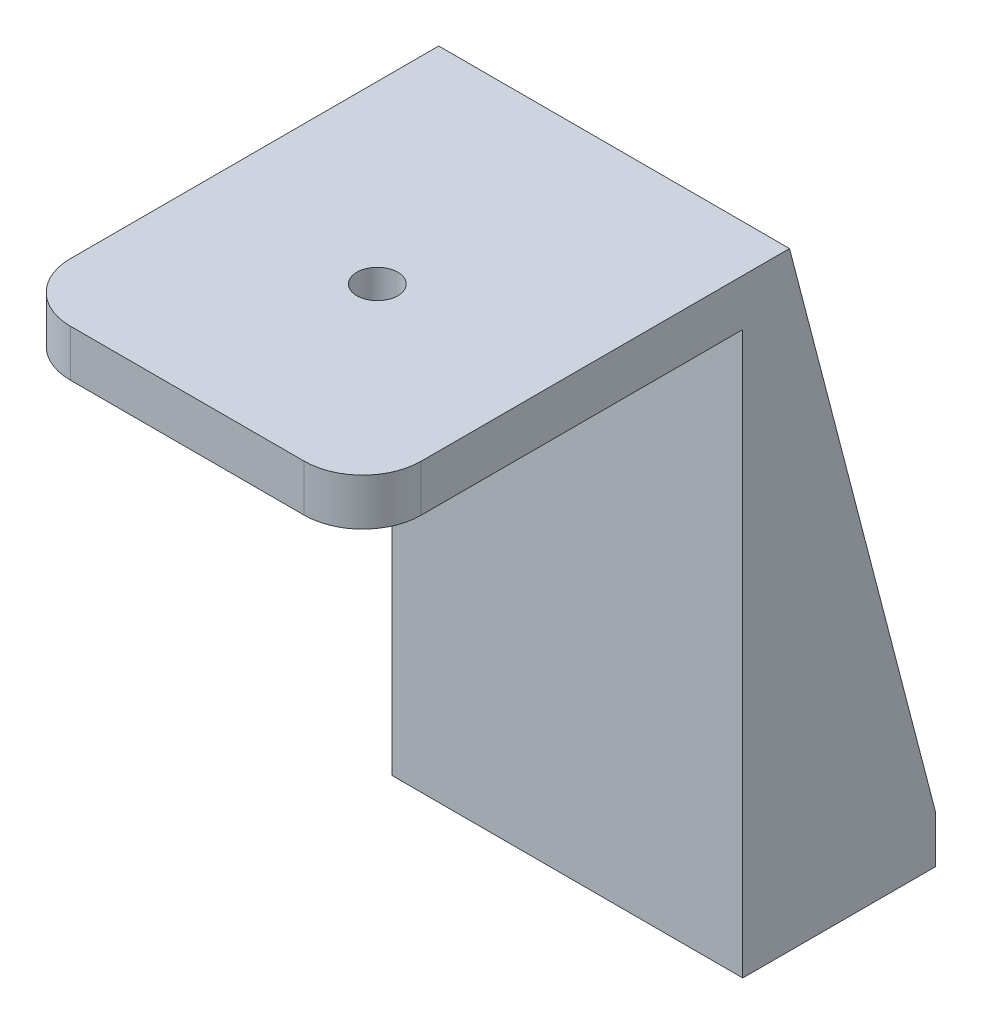
ISO-10303-21;
HEADER;
FILE_DESCRIPTION(('STEP AP214'),'2;1');
FILE_NAME('part.step','',(''),(''),'','','');
FILE_SCHEMA(('AUTOMOTIVE_DESIGN { 1 0 10303 214 1 1 1 1 }'));
ENDSEC;
DATA;
#1=APPLICATION_CONTEXT('core data for automotive mechanical design processes');
#2=APPLICATION_PROTOCOL_DEFINITION('international standard','automotive_design',2000,#1);
#3=PRODUCT_CONTEXT('',#1,'mechanical');
#4=PRODUCT('Part','Part','',(#3));
#5=PRODUCT_RELATED_PRODUCT_CATEGORY('part','',(#4));
#6=PRODUCT_DEFINITION_FORMATION('','',#4);
#7=PRODUCT_DEFINITION_CONTEXT('part definition',#1,'design');
#8=PRODUCT_DEFINITION('design','',#6,#7);
#9=PRODUCT_DEFINITION_SHAPE('','',#8);
#10=(LENGTH_UNIT() NAMED_UNIT(*) SI_UNIT(.MILLI.,.METRE.));
#11=(NAMED_UNIT(*) PLANE_ANGLE_UNIT() SI_UNIT($,.RADIAN.));
#12=(NAMED_UNIT(*) SI_UNIT($,.STERADIAN.) SOLID_ANGLE_UNIT());
#13=UNCERTAINTY_MEASURE_WITH_UNIT(LENGTH_MEASURE(1.E-05),#10,'distance_accuracy_value','');
#14=(GEOMETRIC_REPRESENTATION_CONTEXT(3) GLOBAL_UNCERTAINTY_ASSIGNED_CONTEXT((#13)) GLOBAL_UNIT_ASSIGNED_CONTEXT((#10,
#11,#12)) REPRESENTATION_CONTEXT('',''));
#15=CARTESIAN_POINT('',(0.,0.,0.));
#16=DIRECTION('',(0.,0.,1.));
#17=DIRECTION('',(1.,0.,0.));
#18=AXIS2_PLACEMENT_3D('',#15,#16,#17);
#19=CARTESIAN_POINT('',(-30.,-96.05,-40.5));
#20=DIRECTION('',(0.,0.,-1.));
#21=DIRECTION('',(-1.,0.,0.));
#22=AXIS2_PLACEMENT_3D('',#19,#20,#21);
#23=PLANE('',#22);
#24=DIRECTION('',(1.,0.,0.));
#25=VECTOR('',#24,1.);
#26=CARTESIAN_POINT('',(30.,-88.05,-40.5));
#27=LINE('',#26,#25);
#28=CARTESIAN_POINT('',(-25.,-88.05,-40.5));
#29=VERTEX_POINT('',#28);
#30=CARTESIAN_POINT('',(25.,-88.05,-40.5));
#31=VERTEX_POINT('',#30);
#32=EDGE_CURVE('E37',#29,#31,#27,.T.);
#33=ORIENTED_EDGE('',*,*,#32,.F.);
#34=DIRECTION('',(0.,-1.,0.));
#35=VECTOR('',#34,1.);
#36=CARTESIAN_POINT('',(-25.,-88.05,-40.5));
#37=LINE('',#36,#35);
#38=CARTESIAN_POINT('',(-25.,8.,-40.5));
#39=VERTEX_POINT('',#38);
#40=EDGE_CURVE('E126',#39,#29,#37,.T.);
#41=ORIENTED_EDGE('',*,*,#40,.F.);
#42=DIRECTION('',(-1.,0.,0.));
#43=VECTOR('',#42,1.);
#44=CARTESIAN_POINT('',(-30.,8.,-40.5));
#45=LINE('',#44,#43);
#46=CARTESIAN_POINT('',(25.,8.,-40.5));
#47=VERTEX_POINT('',#46);
#48=EDGE_CURVE('E145',#47,#39,#45,.T.);
#49=ORIENTED_EDGE('',*,*,#48,.F.);
#50=DIRECTION('',(0.,-1.,0.));
#51=VECTOR('',#50,1.);
#52=CARTESIAN_POINT('',(25.,-88.05,-40.5));
#53=LINE('',#52,#51);
#54=EDGE_CURVE('E260',#47,#31,#53,.T.);
#55=ORIENTED_EDGE('',*,*,#54,.T.);
#56=EDGE_LOOP('',(#33,#41,#49,#55));
#57=FACE_BOUND('',#56,.T.);
#58=ADVANCED_FACE('F33',(#57),#23,.T.);
#59=CARTESIAN_POINT('',(30.,-88.05,-65.5));
#60=DIRECTION('',(0.,-1.,0.));
#61=DIRECTION('',(0.,0.,-1.));
#62=AXIS2_PLACEMENT_3D('',#59,#60,#61);
#63=PLANE('',#62);
#64=DIRECTION('',(0.,0.,-1.));
#65=VECTOR('',#64,1.);
#66=CARTESIAN_POINT('',(-25.,-88.05,-65.5));
#67=LINE('',#66,#65);
#68=CARTESIAN_POINT('',(-25.,-88.05,-65.5));
#69=VERTEX_POINT('',#68);
#70=EDGE_CURVE('E128',#29,#69,#67,.T.);
#71=ORIENTED_EDGE('',*,*,#70,.F.);
#72=ORIENTED_EDGE('',*,*,#32,.T.);
#73=DIRECTION('',(0.,0.,-1.));
#74=VECTOR('',#73,1.);
#75=CARTESIAN_POINT('',(25.,-88.05,-65.5));
#76=LINE('',#75,#74);
#77=CARTESIAN_POINT('',(25.,-88.05,-65.5));
#78=VERTEX_POINT('',#77);
#79=EDGE_CURVE('E263',#31,#78,#76,.T.);
#80=ORIENTED_EDGE('',*,*,#79,.T.);
#81=DIRECTION('',(1.,0.,0.));
#82=VECTOR('',#81,1.);
#83=CARTESIAN_POINT('',(30.,-88.05,-65.5));
#84=LINE('',#83,#82);
#85=EDGE_CURVE('E154',#69,#78,#84,.T.);
#86=ORIENTED_EDGE('',*,*,#85,.F.);
#87=EDGE_LOOP('',(#71,#72,#80,#86));
#88=FACE_BOUND('',#87,.T.);
#89=ADVANCED_FACE('F295',(#88),#63,.F.);
#90=CARTESIAN_POINT('',(-30.,8.,-32.5));
#91=DIRECTION('',(1.,0.,0.));
#92=DIRECTION('',(0.,0.,-1.));
#93=AXIS2_PLACEMENT_3D('',#90,#91,#92);
#94=PLANE('',#93);
#95=DIRECTION('',(0.,0.,1.));
#96=VECTOR('',#95,1.);
#97=CARTESIAN_POINT('',(-30.,8.,-32.5));
#98=LINE('',#97,#96);
#99=CARTESIAN_POINT('',(-30.,8.,-40.5));
#100=VERTEX_POINT('',#99);
#101=CARTESIAN_POINT('',(-30.,8.,22.5));
#102=VERTEX_POINT('',#101);
#103=EDGE_CURVE('E182',#100,#102,#98,.T.);
#104=ORIENTED_EDGE('',*,*,#103,.F.);
#105=DIRECTION('',(0.,0.967756221524935,0.251888657346417));
#106=VECTOR('',#105,1.);
#107=CARTESIAN_POINT('',(-30.,8.,-40.5));
#108=LINE('',#107,#106);
#109=CARTESIAN_POINT('',(-30.,-88.05,-65.5));
#110=VERTEX_POINT('',#109);
#111=EDGE_CURVE('E135',#110,#100,#108,.T.);
#112=ORIENTED_EDGE('',*,*,#111,.F.);
#113=DIRECTION('',(0.,1.,0.));
#114=VECTOR('',#113,1.);
#115=CARTESIAN_POINT('',(-30.,-96.05,-65.5));
#116=LINE('',#115,#114);
#117=CARTESIAN_POINT('',(-30.,-96.05,-65.5));
#118=VERTEX_POINT('',#117);
#119=EDGE_CURVE('E245',#118,#110,#116,.T.);
#120=ORIENTED_EDGE('',*,*,#119,.F.);
#121=DIRECTION('',(0.,0.,1.));
#122=VECTOR('',#121,1.);
#123=CARTESIAN_POINT('',(-30.,-96.05,-32.5));
#124=LINE('',#123,#122);
#125=CARTESIAN_POINT('',(-30.,-96.05,-32.5));
#126=VERTEX_POINT('',#125);
#127=EDGE_CURVE('E152',#118,#126,#124,.T.);
#128=ORIENTED_EDGE('',*,*,#127,.T.);
#129=DIRECTION('',(0.,1.,0.));
#130=VECTOR('',#129,1.);
#131=CARTESIAN_POINT('',(-30.,-96.05,-32.5));
#132=LINE('',#131,#130);
#133=CARTESIAN_POINT('',(-30.,0.,-32.5));
#134=VERTEX_POINT('',#133);
#135=EDGE_CURVE('E169',#126,#134,#132,.T.);
#136=ORIENTED_EDGE('',*,*,#135,.T.);
#137=DIRECTION('',(0.,0.,1.));
#138=VECTOR('',#137,1.);
#139=CARTESIAN_POINT('',(-30.,0.,-32.5));
#140=LINE('',#139,#138);
#141=CARTESIAN_POINT('',(-30.,0.,22.5));
#142=VERTEX_POINT('',#141);
#143=EDGE_CURVE('E179',#134,#142,#140,.T.);
#144=ORIENTED_EDGE('',*,*,#143,.T.);
#145=DIRECTION('',(0.,-1.,0.));
#146=VECTOR('',#145,1.);
#147=CARTESIAN_POINT('',(-30.,8.,22.5));
#148=LINE('',#147,#146);
#149=EDGE_CURVE('E211',#142,#102,#148,.F.);
#150=ORIENTED_EDGE('',*,*,#149,.T.);
#151=EDGE_LOOP('',(#104,#112,#120,#128,#136,#144,#150));
#152=FACE_BOUND('',#151,.T.);
#153=ADVANCED_FACE('F231',(#152),#94,.F.);
#154=CARTESIAN_POINT('',(-30.,8.,32.5));
#155=DIRECTION('',(0.,0.,-1.));
#156=DIRECTION('',(-1.,0.,0.));
#157=AXIS2_PLACEMENT_3D('',#154,#155,#156);
#158=PLANE('',#157);
#159=DIRECTION('',(1.,0.,0.));
#160=VECTOR('',#159,1.);
#161=CARTESIAN_POINT('',(-30.,8.,32.5));
#162=LINE('',#161,#160);
#163=CARTESIAN_POINT('',(-20.,8.,32.5));
#164=VERTEX_POINT('',#163);
#165=CARTESIAN_POINT('',(20.,8.,32.5));
#166=VERTEX_POINT('',#165);
#167=EDGE_CURVE('E184',#164,#166,#162,.T.);
#168=ORIENTED_EDGE('',*,*,#167,.F.);
#169=DIRECTION('',(0.,-1.,0.));
#170=VECTOR('',#169,1.);
#171=CARTESIAN_POINT('',(-20.,8.,32.5));
#172=LINE('',#171,#170);
#173=CARTESIAN_POINT('',(-20.,0.,32.5));
#174=VERTEX_POINT('',#173);
#175=EDGE_CURVE('E206',#164,#174,#172,.T.);
#176=ORIENTED_EDGE('',*,*,#175,.T.);
#177=DIRECTION('',(1.,0.,0.));
#178=VECTOR('',#177,1.);
#179=CARTESIAN_POINT('',(-30.,0.,32.5));
#180=LINE('',#179,#178);
#181=CARTESIAN_POINT('',(20.,0.,32.5));
#182=VERTEX_POINT('',#181);
#183=EDGE_CURVE('E190',#174,#182,#180,.T.);
#184=ORIENTED_EDGE('',*,*,#183,.T.);
#185=DIRECTION('',(0.,-1.,0.));
#186=VECTOR('',#185,1.);
#187=CARTESIAN_POINT('',(20.,8.,32.5));
#188=LINE('',#187,#186);
#189=EDGE_CURVE('E189',#182,#166,#188,.F.);
#190=ORIENTED_EDGE('',*,*,#189,.T.);
#191=EDGE_LOOP('',(#168,#176,#184,#190));
#192=FACE_BOUND('',#191,.T.);
#193=ADVANCED_FACE('F221',(#192),#158,.F.);
#194=CARTESIAN_POINT('',(30.,8.,-32.5));
#195=DIRECTION('',(-1.,0.,0.));
#196=DIRECTION('',(0.,0.,1.));
#197=AXIS2_PLACEMENT_3D('',#194,#195,#196);
#198=PLANE('',#197);
#199=DIRECTION('',(0.,0.967756221524935,0.251888657346417));
#200=VECTOR('',#199,1.);
#201=CARTESIAN_POINT('',(30.,8.,-40.5));
#202=LINE('',#201,#200);
#203=CARTESIAN_POINT('',(30.,-88.05,-65.5));
#204=VERTEX_POINT('',#203);
#205=CARTESIAN_POINT('',(30.,8.,-40.5));
#206=VERTEX_POINT('',#205);
#207=EDGE_CURVE('E139',#204,#206,#202,.T.);
#208=ORIENTED_EDGE('',*,*,#207,.T.);
#209=DIRECTION('',(0.,0.,-1.));
#210=VECTOR('',#209,1.);
#211=CARTESIAN_POINT('',(30.,8.,-32.5));
#212=LINE('',#211,#210);
#213=CARTESIAN_POINT('',(30.,8.,22.5));
#214=VERTEX_POINT('',#213);
#215=EDGE_CURVE('E187',#214,#206,#212,.T.);
#216=ORIENTED_EDGE('',*,*,#215,.F.);
#217=DIRECTION('',(0.,-1.,0.));
#218=VECTOR('',#217,1.);
#219=CARTESIAN_POINT('',(30.,8.,22.5));
#220=LINE('',#219,#218);
#221=CARTESIAN_POINT('',(30.,0.,22.5));
#222=VERTEX_POINT('',#221);
#223=EDGE_CURVE('E11',#214,#222,#220,.T.);
#224=ORIENTED_EDGE('',*,*,#223,.T.);
#225=DIRECTION('',(0.,0.,-1.));
#226=VECTOR('',#225,1.);
#227=CARTESIAN_POINT('',(30.,0.,-32.5));
#228=LINE('',#227,#226);
#229=CARTESIAN_POINT('',(30.,0.,-32.5));
#230=VERTEX_POINT('',#229);
#231=EDGE_CURVE('E193',#222,#230,#228,.T.);
#232=ORIENTED_EDGE('',*,*,#231,.T.);
#233=DIRECTION('',(0.,1.,0.));
#234=VECTOR('',#233,1.);
#235=CARTESIAN_POINT('',(30.,-96.05,-32.5));
#236=LINE('',#235,#234);
#237=CARTESIAN_POINT('',(30.,-96.05,-32.5));
#238=VERTEX_POINT('',#237);
#239=EDGE_CURVE('E165',#238,#230,#236,.T.);
#240=ORIENTED_EDGE('',*,*,#239,.F.);
#241=DIRECTION('',(0.,0.,-1.));
#242=VECTOR('',#241,1.);
#243=CARTESIAN_POINT('',(30.,-96.05,-32.5));
#244=LINE('',#243,#242);
#245=CARTESIAN_POINT('',(30.,-96.05,-65.5));
#246=VERTEX_POINT('',#245);
#247=EDGE_CURVE('E158',#238,#246,#244,.T.);
#248=ORIENTED_EDGE('',*,*,#247,.T.);
#249=DIRECTION('',(0.,-1.,0.));
#250=VECTOR('',#249,1.);
#251=CARTESIAN_POINT('',(30.,-96.05,-65.5));
#252=LINE('',#251,#250);
#253=EDGE_CURVE('E251',#204,#246,#252,.T.);
#254=ORIENTED_EDGE('',*,*,#253,.F.);
#255=EDGE_LOOP('',(#208,#216,#224,#232,#240,#248,#254));
#256=FACE_BOUND('',#255,.T.);
#257=ADVANCED_FACE('F277',(#256),#198,.F.);
#258=CARTESIAN_POINT('',(-30.,8.,32.5));
#259=DIRECTION('',(0.,1.,0.));
#260=DIRECTION('',(0.,0.,1.));
#261=AXIS2_PLACEMENT_3D('',#258,#259,#260);
#262=PLANE('',#261);
#263=CARTESIAN_POINT('',(0.,8.,0.));
#264=DIRECTION('',(0.,-1.,0.));
#265=DIRECTION('',(0.,0.,-1.));
#266=AXIS2_PLACEMENT_3D('',#263,#264,#265);
#267=CIRCLE('',#266,3.5);
#268=CARTESIAN_POINT('',(0.,8.,-3.5));
#269=VERTEX_POINT('',#268);
#270=EDGE_CURVE('E170',#269,#269,#267,.T.);
#271=ORIENTED_EDGE('',*,*,#270,.T.);
#272=EDGE_LOOP('',(#271));
#273=FACE_BOUND('',#272,.T.);
#274=ORIENTED_EDGE('',*,*,#103,.T.);
#275=CARTESIAN_POINT('',(-20.,8.,22.5));
#276=DIRECTION('',(0.,1.,0.));
#277=DIRECTION('',(0.,0.,1.));
#278=AXIS2_PLACEMENT_3D('',#275,#276,#277);
#279=CIRCLE('',#278,10.);
#280=EDGE_CURVE('E43',#102,#164,#279,.T.);
#281=ORIENTED_EDGE('',*,*,#280,.T.);
#282=ORIENTED_EDGE('',*,*,#167,.T.);
#283=CARTESIAN_POINT('',(20.,8.,22.5));
#284=DIRECTION('',(0.,1.,0.));
#285=DIRECTION('',(0.,0.,1.));
#286=AXIS2_PLACEMENT_3D('',#283,#284,#285);
#287=CIRCLE('',#286,10.);
#288=EDGE_CURVE('E58',#166,#214,#287,.T.);
#289=ORIENTED_EDGE('',*,*,#288,.T.);
#290=ORIENTED_EDGE('',*,*,#215,.T.);
#291=EDGE_CURVE('E149',#206,#47,#45,.T.);
#292=ORIENTED_EDGE('',*,*,#291,.T.);
#293=ORIENTED_EDGE('',*,*,#48,.T.);
#294=DIRECTION('',(-1.,0.,0.));
#295=VECTOR('',#294,1.);
#296=CARTESIAN_POINT('',(-25.,8.,-40.5));
#297=LINE('',#296,#295);
#298=EDGE_CURVE('E132',#39,#100,#297,.T.);
#299=ORIENTED_EDGE('',*,*,#298,.T.);
#300=EDGE_LOOP('',(#274,#281,#282,#289,#290,#292,#293,#299));
#301=FACE_BOUND('',#300,.T.);
#302=ADVANCED_FACE('F148',(#273,#301),#262,.T.);
#303=CARTESIAN_POINT('',(-30.,0.,32.5));
#304=DIRECTION('',(0.,1.,0.));
#305=DIRECTION('',(0.,0.,1.));
#306=AXIS2_PLACEMENT_3D('',#303,#304,#305);
#307=PLANE('',#306);
#308=CARTESIAN_POINT('',(0.,0.,0.));
#309=DIRECTION('',(0.,-1.,0.));
#310=DIRECTION('',(0.,0.,-1.));
#311=AXIS2_PLACEMENT_3D('',#308,#309,#310);
#312=CIRCLE('',#311,19.05);
#313=CARTESIAN_POINT('',(0.,0.,-19.05));
#314=VERTEX_POINT('',#313);
#315=EDGE_CURVE('E173',#314,#314,#312,.T.);
#316=ORIENTED_EDGE('',*,*,#315,.F.);
#317=EDGE_LOOP('',(#316));
#318=FACE_BOUND('',#317,.T.);
#319=ORIENTED_EDGE('',*,*,#183,.F.);
#320=CARTESIAN_POINT('',(-20.,0.,22.5));
#321=DIRECTION('',(0.,1.,0.));
#322=DIRECTION('',(0.,0.,1.));
#323=AXIS2_PLACEMENT_3D('',#320,#321,#322);
#324=CIRCLE('',#323,10.);
#325=EDGE_CURVE('E209',#174,#142,#324,.F.);
#326=ORIENTED_EDGE('',*,*,#325,.T.);
#327=ORIENTED_EDGE('',*,*,#143,.F.);
#328=DIRECTION('',(-1.,0.,0.));
#329=VECTOR('',#328,1.);
#330=CARTESIAN_POINT('',(-30.,0.,-32.5));
#331=LINE('',#330,#329);
#332=EDGE_CURVE('E185',#230,#134,#331,.T.);
#333=ORIENTED_EDGE('',*,*,#332,.F.);
#334=ORIENTED_EDGE('',*,*,#231,.F.);
#335=CARTESIAN_POINT('',(20.,0.,22.5));
#336=DIRECTION('',(0.,1.,0.));
#337=DIRECTION('',(0.,0.,1.));
#338=AXIS2_PLACEMENT_3D('',#335,#336,#337);
#339=CIRCLE('',#338,10.);
#340=EDGE_CURVE('E207',#222,#182,#339,.F.);
#341=ORIENTED_EDGE('',*,*,#340,.T.);
#342=EDGE_LOOP('',(#319,#326,#327,#333,#334,#341));
#343=FACE_BOUND('',#342,.T.);
#344=ADVANCED_FACE('F227',(#318,#343),#307,.F.);
#345=CARTESIAN_POINT('',(0.,1.6,0.));
#346=DIRECTION('',(0.,-1.,0.));
#347=DIRECTION('',(0.,0.,-1.));
#348=AXIS2_PLACEMENT_3D('',#345,#346,#347);
#349=CYLINDRICAL_SURFACE('',#348,19.05);
#350=CARTESIAN_POINT('',(0.,1.6,0.));
#351=DIRECTION('',(0.,-1.,0.));
#352=DIRECTION('',(0.,0.,-1.));
#353=AXIS2_PLACEMENT_3D('',#350,#351,#352);
#354=CIRCLE('',#353,19.05);
#355=CARTESIAN_POINT('',(0.,1.6,-19.05));
#356=VERTEX_POINT('',#355);
#357=EDGE_CURVE('E176',#356,#356,#354,.T.);
#358=ORIENTED_EDGE('',*,*,#357,.F.);
#359=EDGE_LOOP('',(#358));
#360=FACE_BOUND('',#359,.T.);
#361=ORIENTED_EDGE('',*,*,#315,.T.);
#362=EDGE_LOOP('',(#361));
#363=FACE_BOUND('',#362,.T.);
#364=ADVANCED_FACE('F308',(#360,#363),#349,.F.);
#365=CARTESIAN_POINT('',(0.,1.6,0.));
#366=DIRECTION('',(0.,-1.,0.));
#367=DIRECTION('',(0.,0.,-1.));
#368=AXIS2_PLACEMENT_3D('',#365,#366,#367);
#369=PLANE('',#368);
#370=CARTESIAN_POINT('',(0.,1.6,0.));
#371=DIRECTION('',(0.,-1.,0.));
#372=DIRECTION('',(0.,0.,-1.));
#373=AXIS2_PLACEMENT_3D('',#370,#371,#372);
#374=CIRCLE('',#373,3.5);
#375=CARTESIAN_POINT('',(0.,1.6,-3.5));
#376=VERTEX_POINT('',#375);
#377=EDGE_CURVE('E168',#376,#376,#374,.T.);
#378=ORIENTED_EDGE('',*,*,#377,.F.);
#379=EDGE_LOOP('',(#378));
#380=FACE_BOUND('',#379,.T.);
#381=ORIENTED_EDGE('',*,*,#357,.T.);
#382=EDGE_LOOP('',(#381));
#383=FACE_BOUND('',#382,.T.);
#384=ADVANCED_FACE('F304',(#380,#383),#369,.T.);
#385=CARTESIAN_POINT('',(0.,8.,0.));
#386=DIRECTION('',(0.,-1.,0.));
#387=DIRECTION('',(0.,0.,-1.));
#388=AXIS2_PLACEMENT_3D('',#385,#386,#387);
#389=CYLINDRICAL_SURFACE('',#388,3.5);
#390=ORIENTED_EDGE('',*,*,#270,.F.);
#391=EDGE_LOOP('',(#390));
#392=FACE_BOUND('',#391,.T.);
#393=ORIENTED_EDGE('',*,*,#377,.T.);
#394=EDGE_LOOP('',(#393));
#395=FACE_BOUND('',#394,.T.);
#396=ADVANCED_FACE('F290',(#392,#395),#389,.F.);
#397=CARTESIAN_POINT('',(-30.,-96.05,-32.5));
#398=DIRECTION('',(0.,0.,1.));
#399=DIRECTION('',(1.,0.,0.));
#400=AXIS2_PLACEMENT_3D('',#397,#398,#399);
#401=PLANE('',#400);
#402=ORIENTED_EDGE('',*,*,#239,.T.);
#403=ORIENTED_EDGE('',*,*,#332,.T.);
#404=ORIENTED_EDGE('',*,*,#135,.F.);
#405=DIRECTION('',(1.,0.,0.));
#406=VECTOR('',#405,1.);
#407=CARTESIAN_POINT('',(-30.,-96.05,-32.5));
#408=LINE('',#407,#406);
#409=EDGE_CURVE('E237',#126,#238,#408,.T.);
#410=ORIENTED_EDGE('',*,*,#409,.T.);
#411=EDGE_LOOP('',(#402,#403,#404,#410));
#412=FACE_BOUND('',#411,.T.);
#413=ADVANCED_FACE('F284',(#412),#401,.T.);
#414=CARTESIAN_POINT('',(-30.,-96.05,-40.5));
#415=DIRECTION('',(0.,-1.,0.));
#416=DIRECTION('',(0.,0.,-1.));
#417=AXIS2_PLACEMENT_3D('',#414,#415,#416);
#418=PLANE('',#417);
#419=ORIENTED_EDGE('',*,*,#127,.F.);
#420=DIRECTION('',(-1.,0.,0.));
#421=VECTOR('',#420,1.);
#422=CARTESIAN_POINT('',(30.,-96.05,-65.5));
#423=LINE('',#422,#421);
#424=EDGE_CURVE('E248',#246,#118,#423,.T.);
#425=ORIENTED_EDGE('',*,*,#424,.F.);
#426=ORIENTED_EDGE('',*,*,#247,.F.);
#427=ORIENTED_EDGE('',*,*,#409,.F.);
#428=EDGE_LOOP('',(#419,#425,#426,#427));
#429=FACE_BOUND('',#428,.T.);
#430=ADVANCED_FACE('F282',(#429),#418,.T.);
#431=CARTESIAN_POINT('',(-20.,8.,22.5));
#432=DIRECTION('',(0.,-1.,0.));
#433=DIRECTION('',(0.,0.,-1.));
#434=AXIS2_PLACEMENT_3D('',#431,#432,#433);
#435=CYLINDRICAL_SURFACE('',#434,10.);
#436=ORIENTED_EDGE('',*,*,#280,.F.);
#437=ORIENTED_EDGE('',*,*,#149,.F.);
#438=ORIENTED_EDGE('',*,*,#325,.F.);
#439=ORIENTED_EDGE('',*,*,#175,.F.);
#440=EDGE_LOOP('',(#436,#437,#438,#439));
#441=FACE_BOUND('',#440,.T.);
#442=ADVANCED_FACE('F224',(#441),#435,.T.);
#443=CARTESIAN_POINT('',(20.,8.,22.5));
#444=DIRECTION('',(0.,-1.,0.));
#445=DIRECTION('',(0.,0.,-1.));
#446=AXIS2_PLACEMENT_3D('',#443,#444,#445);
#447=CYLINDRICAL_SURFACE('',#446,10.);
#448=ORIENTED_EDGE('',*,*,#288,.F.);
#449=ORIENTED_EDGE('',*,*,#189,.F.);
#450=ORIENTED_EDGE('',*,*,#340,.F.);
#451=ORIENTED_EDGE('',*,*,#223,.F.);
#452=EDGE_LOOP('',(#448,#449,#450,#451));
#453=FACE_BOUND('',#452,.T.);
#454=ADVANCED_FACE('F35',(#453),#447,.T.);
#455=CARTESIAN_POINT('',(30.,-88.05,-65.5));
#456=DIRECTION('',(0.,0.,1.));
#457=DIRECTION('',(1.,0.,0.));
#458=AXIS2_PLACEMENT_3D('',#455,#456,#457);
#459=PLANE('',#458);
#460=ORIENTED_EDGE('',*,*,#253,.T.);
#461=ORIENTED_EDGE('',*,*,#424,.T.);
#462=ORIENTED_EDGE('',*,*,#119,.T.);
#463=EDGE_CURVE('E150',#110,#69,#84,.T.);
#464=ORIENTED_EDGE('',*,*,#463,.T.);
#465=ORIENTED_EDGE('',*,*,#85,.T.);
#466=DIRECTION('',(1.,0.,0.));
#467=VECTOR('',#466,1.);
#468=CARTESIAN_POINT('',(25.,-88.05,-65.5));
#469=LINE('',#468,#467);
#470=EDGE_CURVE('E254',#78,#204,#469,.T.);
#471=ORIENTED_EDGE('',*,*,#470,.T.);
#472=EDGE_LOOP('',(#460,#461,#462,#464,#465,#471));
#473=FACE_BOUND('',#472,.T.);
#474=ADVANCED_FACE('F276',(#473),#459,.F.);
#475=CARTESIAN_POINT('',(25.,8.,-40.5));
#476=DIRECTION('',(0.,0.251888657346417,-0.967756221524935));
#477=DIRECTION('',(0.,0.967756221524935,0.251888657346417));
#478=AXIS2_PLACEMENT_3D('',#475,#476,#477);
#479=PLANE('',#478);
#480=ORIENTED_EDGE('',*,*,#207,.F.);
#481=ORIENTED_EDGE('',*,*,#470,.F.);
#482=DIRECTION('',(0.,0.967756221524935,0.251888657346417));
#483=VECTOR('',#482,1.);
#484=CARTESIAN_POINT('',(25.,8.,-40.5));
#485=LINE('',#484,#483);
#486=EDGE_CURVE('E257',#78,#47,#485,.T.);
#487=ORIENTED_EDGE('',*,*,#486,.T.);
#488=ORIENTED_EDGE('',*,*,#291,.F.);
#489=EDGE_LOOP('',(#480,#481,#487,#488));
#490=FACE_BOUND('',#489,.T.);
#491=ADVANCED_FACE('F274',(#490),#479,.T.);
#492=CARTESIAN_POINT('',(25.,-88.05,-40.5));
#493=DIRECTION('',(1.,0.,0.));
#494=DIRECTION('',(0.,0.,-1.));
#495=AXIS2_PLACEMENT_3D('',#492,#493,#494);
#496=PLANE('',#495);
#497=ORIENTED_EDGE('',*,*,#54,.F.);
#498=ORIENTED_EDGE('',*,*,#486,.F.);
#499=ORIENTED_EDGE('',*,*,#79,.F.);
#500=EDGE_LOOP('',(#497,#498,#499));
#501=FACE_BOUND('',#500,.T.);
#502=ADVANCED_FACE('F271',(#501),#496,.F.);
#503=CARTESIAN_POINT('',(-25.,8.,-40.5));
#504=DIRECTION('',(0.,-0.251888657346417,0.967756221524935));
#505=DIRECTION('',(0.,-0.967756221524935,-0.251888657346417));
#506=AXIS2_PLACEMENT_3D('',#503,#504,#505);
#507=PLANE('',#506);
#508=ORIENTED_EDGE('',*,*,#111,.T.);
#509=ORIENTED_EDGE('',*,*,#298,.F.);
#510=DIRECTION('',(0.,0.967756221524935,0.251888657346417));
#511=VECTOR('',#510,1.);
#512=CARTESIAN_POINT('',(-25.,8.,-40.5));
#513=LINE('',#512,#511);
#514=EDGE_CURVE('E50',#69,#39,#513,.T.);
#515=ORIENTED_EDGE('',*,*,#514,.F.);
#516=ORIENTED_EDGE('',*,*,#463,.F.);
#517=EDGE_LOOP('',(#508,#509,#515,#516));
#518=FACE_BOUND('',#517,.T.);
#519=ADVANCED_FACE('F133',(#518),#507,.F.);
#520=CARTESIAN_POINT('',(-25.,-88.05,-40.5));
#521=DIRECTION('',(-1.,0.,0.));
#522=DIRECTION('',(0.,0.,-1.));
#523=AXIS2_PLACEMENT_3D('',#520,#521,#522);
#524=PLANE('',#523);
#525=ORIENTED_EDGE('',*,*,#40,.T.);
#526=ORIENTED_EDGE('',*,*,#70,.T.);
#527=ORIENTED_EDGE('',*,*,#514,.T.);
#528=EDGE_LOOP('',(#525,#526,#527));
#529=FACE_BOUND('',#528,.T.);
#530=ADVANCED_FACE('F124',(#529),#524,.F.);
#531=CLOSED_SHELL('',(#58,#89,#153,#193,#257,#302,#344,#364,#384,#396,#413,#430,#442,#454,#474,
#491,#502,#519,#530));
#532=MANIFOLD_SOLID_BREP('B2',#531);
#533=ADVANCED_BREP_SHAPE_REPRESENTATION('',(#18,#532),#14);
#534=SHAPE_DEFINITION_REPRESENTATION(#9,#533);
ENDSEC;
END-ISO-10303-21;
